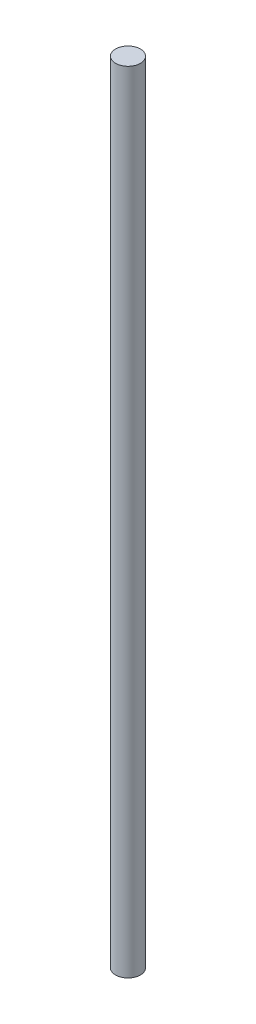
ISO-10303-21;
HEADER;
FILE_DESCRIPTION(('STEP AP214'),'2;1');
FILE_NAME('part.step','',(''),(''),'','','');
FILE_SCHEMA(('AUTOMOTIVE_DESIGN { 1 0 10303 214 1 1 1 1 }'));
ENDSEC;
DATA;
#1=APPLICATION_CONTEXT('core data for automotive mechanical design processes');
#2=APPLICATION_PROTOCOL_DEFINITION('international standard','automotive_design',2000,#1);
#3=PRODUCT_CONTEXT('',#1,'mechanical');
#4=PRODUCT('Part','Part','',(#3));
#5=PRODUCT_RELATED_PRODUCT_CATEGORY('part','',(#4));
#6=PRODUCT_DEFINITION_FORMATION('','',#4);
#7=PRODUCT_DEFINITION_CONTEXT('part definition',#1,'design');
#8=PRODUCT_DEFINITION('design','',#6,#7);
#9=PRODUCT_DEFINITION_SHAPE('','',#8);
#10=(LENGTH_UNIT() NAMED_UNIT(*) SI_UNIT(.MILLI.,.METRE.));
#11=(NAMED_UNIT(*) PLANE_ANGLE_UNIT() SI_UNIT($,.RADIAN.));
#12=(NAMED_UNIT(*) SI_UNIT($,.STERADIAN.) SOLID_ANGLE_UNIT());
#13=UNCERTAINTY_MEASURE_WITH_UNIT(LENGTH_MEASURE(1.E-05),#10,'distance_accuracy_value','');
#14=(GEOMETRIC_REPRESENTATION_CONTEXT(3) GLOBAL_UNCERTAINTY_ASSIGNED_CONTEXT((#13)) GLOBAL_UNIT_ASSIGNED_CONTEXT((#10,
#11,#12)) REPRESENTATION_CONTEXT('',''));
#15=CARTESIAN_POINT('',(0.,0.,0.));
#16=DIRECTION('',(0.,0.,1.));
#17=DIRECTION('',(1.,0.,0.));
#18=AXIS2_PLACEMENT_3D('',#15,#16,#17);
#19=CARTESIAN_POINT('',(0.,254.,0.));
#20=DIRECTION('',(0.,-1.,0.));
#21=DIRECTION('',(0.,0.,-1.));
#22=AXIS2_PLACEMENT_3D('',#19,#20,#21);
#23=CYLINDRICAL_SURFACE('',#22,4.);
#24=CARTESIAN_POINT('',(0.,254.,0.));
#25=DIRECTION('',(0.,1.,0.));
#26=DIRECTION('',(0.,0.,1.));
#27=AXIS2_PLACEMENT_3D('',#24,#25,#26);
#28=CIRCLE('',#27,4.);
#29=CARTESIAN_POINT('',(0.,254.,4.));
#30=VERTEX_POINT('',#29);
#31=EDGE_CURVE('E10',#30,#30,#28,.T.);
#32=ORIENTED_EDGE('',*,*,#31,.F.);
#33=EDGE_LOOP('',(#32));
#34=FACE_BOUND('',#33,.T.);
#35=CARTESIAN_POINT('',(0.,0.,0.));
#36=DIRECTION('',(0.,1.,0.));
#37=DIRECTION('',(0.,0.,1.));
#38=AXIS2_PLACEMENT_3D('',#35,#36,#37);
#39=CIRCLE('',#38,4.);
#40=CARTESIAN_POINT('',(0.,0.,4.));
#41=VERTEX_POINT('',#40);
#42=EDGE_CURVE('E34',#41,#41,#39,.T.);
#43=ORIENTED_EDGE('',*,*,#42,.T.);
#44=EDGE_LOOP('',(#43));
#45=FACE_BOUND('',#44,.T.);
#46=ADVANCED_FACE('F31',(#34,#45),#23,.T.);
#47=CARTESIAN_POINT('',(0.,254.,0.));
#48=DIRECTION('',(0.,1.,0.));
#49=DIRECTION('',(0.,0.,1.));
#50=AXIS2_PLACEMENT_3D('',#47,#48,#49);
#51=PLANE('',#50);
#52=ORIENTED_EDGE('',*,*,#31,.T.);
#53=EDGE_LOOP('',(#52));
#54=FACE_BOUND('',#53,.T.);
#55=ADVANCED_FACE('F46',(#54),#51,.T.);
#56=CARTESIAN_POINT('',(0.,0.,0.));
#57=DIRECTION('',(0.,1.,0.));
#58=DIRECTION('',(0.,0.,1.));
#59=AXIS2_PLACEMENT_3D('',#56,#57,#58);
#60=PLANE('',#59);
#61=ORIENTED_EDGE('',*,*,#42,.F.);
#62=EDGE_LOOP('',(#61));
#63=FACE_BOUND('',#62,.T.);
#64=ADVANCED_FACE('F44',(#63),#60,.F.);
#65=CLOSED_SHELL('',(#46,#55,#64));
#66=MANIFOLD_SOLID_BREP('B2',#65);
#67=ADVANCED_BREP_SHAPE_REPRESENTATION('',(#18,#66),#14);
#68=SHAPE_DEFINITION_REPRESENTATION(#9,#67);
ENDSEC;
END-ISO-10303-21;
